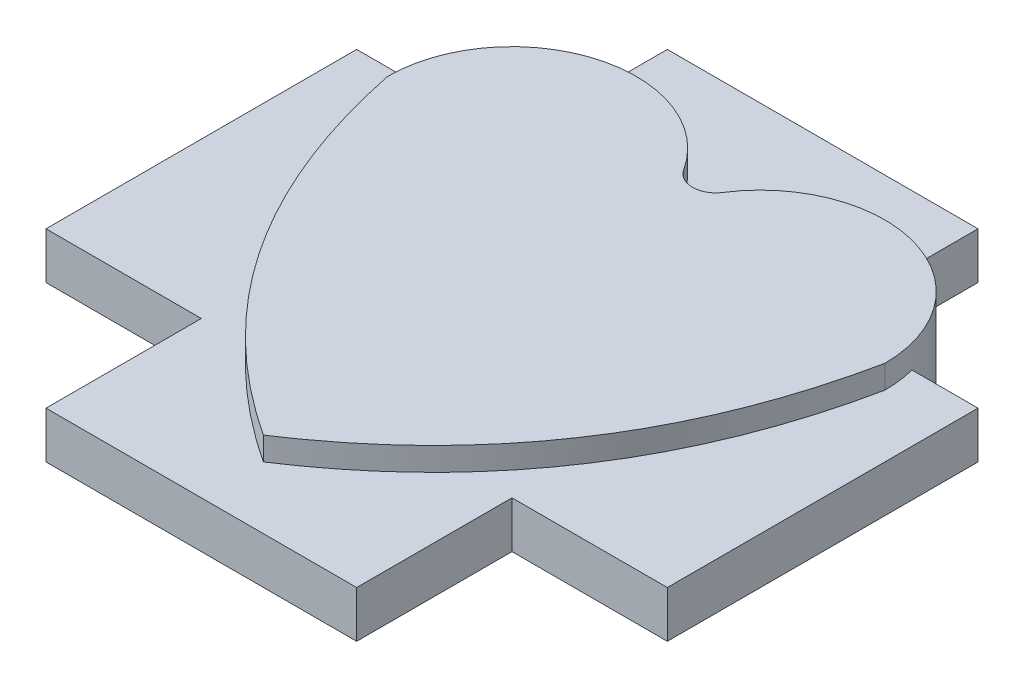
ISO-10303-21;
HEADER;
FILE_DESCRIPTION(('STEP AP214'),'2;1');
FILE_NAME('part.step','',(''),(''),'','','');
FILE_SCHEMA(('AUTOMOTIVE_DESIGN { 1 0 10303 214 1 1 1 1 }'));
ENDSEC;
DATA;
#1=APPLICATION_CONTEXT('core data for automotive mechanical design processes');
#2=APPLICATION_PROTOCOL_DEFINITION('international standard','automotive_design',2000,#1);
#3=PRODUCT_CONTEXT('',#1,'mechanical');
#4=PRODUCT('Part','Part','',(#3));
#5=PRODUCT_RELATED_PRODUCT_CATEGORY('part','',(#4));
#6=PRODUCT_DEFINITION_FORMATION('','',#4);
#7=PRODUCT_DEFINITION_CONTEXT('part definition',#1,'design');
#8=PRODUCT_DEFINITION('design','',#6,#7);
#9=PRODUCT_DEFINITION_SHAPE('','',#8);
#10=(LENGTH_UNIT() NAMED_UNIT(*) SI_UNIT(.MILLI.,.METRE.));
#11=(NAMED_UNIT(*) PLANE_ANGLE_UNIT() SI_UNIT($,.RADIAN.));
#12=(NAMED_UNIT(*) SI_UNIT($,.STERADIAN.) SOLID_ANGLE_UNIT());
#13=UNCERTAINTY_MEASURE_WITH_UNIT(LENGTH_MEASURE(1.E-05),#10,'distance_accuracy_value','');
#14=(GEOMETRIC_REPRESENTATION_CONTEXT(3) GLOBAL_UNCERTAINTY_ASSIGNED_CONTEXT((#13)) GLOBAL_UNIT_ASSIGNED_CONTEXT((#10,
#11,#12)) REPRESENTATION_CONTEXT('',''));
#15=CARTESIAN_POINT('',(0.,0.,0.));
#16=DIRECTION('',(0.,0.,1.));
#17=DIRECTION('',(1.,0.,0.));
#18=AXIS2_PLACEMENT_3D('',#15,#16,#17);
#19=CARTESIAN_POINT('',(8.,3.,-4.));
#20=CARTESIAN_POINT('',(6.40333694662844,3.,3.8115441038304));
#21=CARTESIAN_POINT('',(0.,3.,8.));
#22=B_SPLINE_CURVE_WITH_KNOTS('',2,(#19,#20,#21),.UNSPECIFIED.,.F.,.F.,(3,3),(0.,1.),.UNSPECIFIED.);
#23=DIRECTION('',(0.,-1.,0.));
#24=VECTOR('',#23,1.);
#25=SURFACE_OF_LINEAR_EXTRUSION('',#22,#24);
#26=DIRECTION('',(0.,-1.,0.));
#27=VECTOR('',#26,1.);
#28=CARTESIAN_POINT('',(8.,3.,-4.));
#29=LINE('',#28,#27);
#30=CARTESIAN_POINT('',(8.,0.75,-4.));
#31=VERTEX_POINT('',#30);
#32=CARTESIAN_POINT('',(8.,0.,-4.));
#33=VERTEX_POINT('',#32);
#34=EDGE_CURVE('E51',#31,#33,#29,.T.);
#35=ORIENTED_EDGE('',*,*,#34,.F.);
#36=CARTESIAN_POINT('',(-802083.484499999,0.75,-597230.82877802));
#37=CARTESIAN_POINT('',(798560.307176634,0.75,601924.662589199));
#38=CARTESIAN_POINT('',(-795018.634104275,0.75,-606603.615199584));
#39=B_SPLINE_CURVE_WITH_KNOTS('',2,(#36,#37,#38),.UNSPECIFIED.,.F.,.F.,(3,3),(0.,1.),.UNSPECIFIED.);
#40=CARTESIAN_POINT('',(6.12221384699296E-09,0.75,7.99999999619871));
#41=VERTEX_POINT('',#40);
#42=EDGE_CURVE('E264',#41,#31,#39,.T.);
#43=ORIENTED_EDGE('',*,*,#42,.F.);
#44=DIRECTION('',(0.,-1.,0.));
#45=VECTOR('',#44,1.);
#46=CARTESIAN_POINT('',(0.,3.,8.));
#47=LINE('',#46,#45);
#48=CARTESIAN_POINT('',(0.,0.,8.));
#49=VERTEX_POINT('',#48);
#50=EDGE_CURVE('E430',#41,#49,#47,.T.);
#51=ORIENTED_EDGE('',*,*,#50,.T.);
#52=CARTESIAN_POINT('',(8.,0.,-4.));
#53=CARTESIAN_POINT('',(6.40333694662844,0.,3.8115441038304));
#54=CARTESIAN_POINT('',(0.,0.,8.));
#55=B_SPLINE_CURVE_WITH_KNOTS('',2,(#52,#53,#54),.UNSPECIFIED.,.F.,.F.,(3,3),(0.,1.),.UNSPECIFIED.);
#56=EDGE_CURVE('E394',#33,#49,#55,.T.);
#57=ORIENTED_EDGE('',*,*,#56,.F.);
#58=EDGE_LOOP('',(#35,#43,#51,#57));
#59=FACE_BOUND('',#58,.T.);
#60=ADVANCED_FACE('F41',(#59),#25,.T.);
#61=CARTESIAN_POINT('',(-8.,3.,-4.));
#62=CARTESIAN_POINT('',(-6.40333694662844,3.,3.81154410383039));
#63=CARTESIAN_POINT('',(0.,3.,8.));
#64=B_SPLINE_CURVE_WITH_KNOTS('',2,(#61,#62,#63),.UNSPECIFIED.,.F.,.F.,(3,3),(0.,1.),.UNSPECIFIED.);
#65=DIRECTION('',(0.,-1.,0.));
#66=VECTOR('',#65,1.);
#67=SURFACE_OF_LINEAR_EXTRUSION('',#64,#66);
#68=CARTESIAN_POINT('',(795018.634104553,0.75,-606603.615199218));
#69=CARTESIAN_POINT('',(-798560.307176635,0.75,601924.662589195));
#70=CARTESIAN_POINT('',(802083.484499718,0.75,-597230.828778395));
#71=B_SPLINE_CURVE_WITH_KNOTS('',2,(#68,#69,#70),.UNSPECIFIED.,.F.,.F.,(3,3),(0.,1.),.UNSPECIFIED.);
#72=CARTESIAN_POINT('',(-8.,0.75,-4.));
#73=VERTEX_POINT('',#72);
#74=EDGE_CURVE('E569',#73,#41,#71,.T.);
#75=ORIENTED_EDGE('',*,*,#74,.F.);
#76=DIRECTION('',(0.,-1.,0.));
#77=VECTOR('',#76,1.);
#78=CARTESIAN_POINT('',(-8.,3.,-4.));
#79=LINE('',#78,#77);
#80=CARTESIAN_POINT('',(-8.,0.,-4.));
#81=VERTEX_POINT('',#80);
#82=EDGE_CURVE('E519',#73,#81,#79,.T.);
#83=ORIENTED_EDGE('',*,*,#82,.T.);
#84=CARTESIAN_POINT('',(-8.,0.,-4.));
#85=CARTESIAN_POINT('',(-6.40333694662844,0.,3.81154410383039));
#86=CARTESIAN_POINT('',(0.,0.,8.));
#87=B_SPLINE_CURVE_WITH_KNOTS('',2,(#84,#85,#86),.UNSPECIFIED.,.F.,.F.,(3,3),(0.,1.),.UNSPECIFIED.);
#88=EDGE_CURVE('E411',#81,#49,#87,.T.);
#89=ORIENTED_EDGE('',*,*,#88,.T.);
#90=ORIENTED_EDGE('',*,*,#50,.F.);
#91=EDGE_LOOP('',(#75,#83,#89,#90));
#92=FACE_BOUND('',#91,.T.);
#93=ADVANCED_FACE('F445',(#92),#67,.F.);
#94=CARTESIAN_POINT('',(4.,3.,-4.));
#95=DIRECTION('',(0.,-1.,0.));
#96=DIRECTION('',(0.,0.,-1.));
#97=AXIS2_PLACEMENT_3D('',#94,#95,#96);
#98=CYLINDRICAL_SURFACE('',#97,4.);
#99=CARTESIAN_POINT('',(8.,3.,-4.));
#100=VERTEX_POINT('',#99);
#101=CARTESIAN_POINT('',(8.,2.25,-4.));
#102=VERTEX_POINT('',#101);
#103=EDGE_CURVE('E11',#100,#102,#29,.T.);
#104=ORIENTED_EDGE('',*,*,#103,.T.);
#105=CARTESIAN_POINT('',(4.,2.25,-4.));
#106=DIRECTION('',(0.,1.,0.));
#107=DIRECTION('',(0.,0.,1.));
#108=AXIS2_PLACEMENT_3D('',#105,#106,#107);
#109=CIRCLE('',#108,3.99999999984593);
#110=CARTESIAN_POINT('',(7.87298334620742,2.25,-5.));
#111=VERTEX_POINT('',#110);
#112=EDGE_CURVE('E57',#102,#111,#109,.T.);
#113=ORIENTED_EDGE('',*,*,#112,.T.);
#114=DIRECTION('',(0.,-1.,0.));
#115=VECTOR('',#114,1.);
#116=CARTESIAN_POINT('',(7.8729833460483,2.25,-5.));
#117=LINE('',#116,#115);
#118=CARTESIAN_POINT('',(7.87298334619747,0.75,-5.00000000003852));
#119=VERTEX_POINT('',#118);
#120=EDGE_CURVE('E61',#111,#119,#117,.T.);
#121=ORIENTED_EDGE('',*,*,#120,.T.);
#122=CARTESIAN_POINT('',(4.,0.75,-4.));
#123=DIRECTION('',(0.,1.,0.));
#124=DIRECTION('',(0.,0.,1.));
#125=AXIS2_PLACEMENT_3D('',#122,#123,#124);
#126=CIRCLE('',#125,3.99999999984593);
#127=EDGE_CURVE('E261',#31,#119,#126,.T.);
#128=ORIENTED_EDGE('',*,*,#127,.F.);
#129=ORIENTED_EDGE('',*,*,#34,.T.);
#130=CARTESIAN_POINT('',(4.,0.,-4.));
#131=DIRECTION('',(0.,1.,0.));
#132=DIRECTION('',(0.,0.,1.));
#133=AXIS2_PLACEMENT_3D('',#130,#131,#132);
#134=CIRCLE('',#133,4.);
#135=CARTESIAN_POINT('',(0.631578947368423,0.,-6.1572527928336));
#136=VERTEX_POINT('',#135);
#137=EDGE_CURVE('E544',#33,#136,#134,.T.);
#138=ORIENTED_EDGE('',*,*,#137,.T.);
#139=DIRECTION('',(0.,-1.,0.));
#140=VECTOR('',#139,1.);
#141=CARTESIAN_POINT('',(0.631578947368423,3.,-6.1572527928336));
#142=LINE('',#141,#140);
#143=CARTESIAN_POINT('',(0.631578947498164,0.75,-6.15725279275051));
#144=VERTEX_POINT('',#143);
#145=EDGE_CURVE('E529',#144,#136,#142,.T.);
#146=ORIENTED_EDGE('',*,*,#145,.F.);
#147=CARTESIAN_POINT('',(4.,0.75,-4.));
#148=DIRECTION('',(0.,1.,0.));
#149=DIRECTION('',(0.,0.,1.));
#150=AXIS2_PLACEMENT_3D('',#147,#148,#149);
#151=CIRCLE('',#150,3.99999999984593);
#152=CARTESIAN_POINT('',(5.,0.75,-7.87298334604829));
#153=VERTEX_POINT('',#152);
#154=EDGE_CURVE('E376',#153,#144,#151,.T.);
#155=ORIENTED_EDGE('',*,*,#154,.F.);
#156=DIRECTION('',(0.,1.,0.));
#157=VECTOR('',#156,1.);
#158=CARTESIAN_POINT('',(5.,0.75,-7.87298334604829));
#159=LINE('',#158,#157);
#160=CARTESIAN_POINT('',(5.,2.25,-7.87298334604829));
#161=VERTEX_POINT('',#160);
#162=EDGE_CURVE('E389',#153,#161,#159,.T.);
#163=ORIENTED_EDGE('',*,*,#162,.T.);
#164=CARTESIAN_POINT('',(4.,2.25,-4.));
#165=DIRECTION('',(0.,1.,0.));
#166=DIRECTION('',(0.,0.,1.));
#167=AXIS2_PLACEMENT_3D('',#164,#165,#166);
#168=CIRCLE('',#167,3.99999999984593);
#169=CARTESIAN_POINT('',(0.631578947498164,2.25,-6.15725279275051));
#170=VERTEX_POINT('',#169);
#171=EDGE_CURVE('E354',#161,#170,#168,.T.);
#172=ORIENTED_EDGE('',*,*,#171,.T.);
#173=CARTESIAN_POINT('',(0.631578947368423,3.,-6.1572527928336));
#174=VERTEX_POINT('',#173);
#175=EDGE_CURVE('E530',#174,#170,#142,.T.);
#176=ORIENTED_EDGE('',*,*,#175,.F.);
#177=CARTESIAN_POINT('',(4.,3.,-4.));
#178=DIRECTION('',(0.,1.,0.));
#179=DIRECTION('',(0.,0.,1.));
#180=AXIS2_PLACEMENT_3D('',#177,#178,#179);
#181=CIRCLE('',#180,4.);
#182=EDGE_CURVE('E410',#100,#174,#181,.T.);
#183=ORIENTED_EDGE('',*,*,#182,.F.);
#184=EDGE_LOOP('',(#104,#113,#121,#128,#129,#138,#146,#155,#163,#172,#176,#183));
#185=FACE_BOUND('',#184,.T.);
#186=ADVANCED_FACE('F455',(#185),#98,.T.);
#187=CARTESIAN_POINT('',(0.,3.,-6.5617376914899));
#188=DIRECTION('',(0.,-1.,0.));
#189=DIRECTION('',(0.,0.,-1.));
#190=AXIS2_PLACEMENT_3D('',#187,#188,#189);
#191=CYLINDRICAL_SURFACE('',#190,0.75);
#192=DIRECTION('',(0.,-1.,0.));
#193=VECTOR('',#192,1.);
#194=CARTESIAN_POINT('',(-0.631578947368419,3.,-6.1572527928336));
#195=LINE('',#194,#193);
#196=CARTESIAN_POINT('',(-0.63157894736842,0.75,-6.1572527928336));
#197=VERTEX_POINT('',#196);
#198=CARTESIAN_POINT('',(-0.631578947368419,0.,-6.1572527928336));
#199=VERTEX_POINT('',#198);
#200=EDGE_CURVE('E518',#197,#199,#195,.T.);
#201=ORIENTED_EDGE('',*,*,#200,.F.);
#202=CARTESIAN_POINT('',(0.,0.75,-6.5617376914899));
#203=DIRECTION('',(0.,1.,0.));
#204=DIRECTION('',(0.,0.,1.));
#205=AXIS2_PLACEMENT_3D('',#202,#203,#204);
#206=CIRCLE('',#205,0.75);
#207=EDGE_CURVE('E372',#197,#144,#206,.T.);
#208=ORIENTED_EDGE('',*,*,#207,.T.);
#209=ORIENTED_EDGE('',*,*,#145,.T.);
#210=CARTESIAN_POINT('',(0.,0.,-6.5617376914899));
#211=DIRECTION('',(0.,1.,0.));
#212=DIRECTION('',(0.,0.,1.));
#213=AXIS2_PLACEMENT_3D('',#210,#211,#212);
#214=CIRCLE('',#213,0.75);
#215=EDGE_CURVE('E541',#199,#136,#214,.T.);
#216=ORIENTED_EDGE('',*,*,#215,.F.);
#217=EDGE_LOOP('',(#201,#208,#209,#216));
#218=FACE_BOUND('',#217,.T.);
#219=ADVANCED_FACE('F451',(#218),#191,.F.);
#220=CARTESIAN_POINT('',(-4.,3.,-4.));
#221=DIRECTION('',(0.,-1.,0.));
#222=DIRECTION('',(0.,0.,-1.));
#223=AXIS2_PLACEMENT_3D('',#220,#221,#222);
#224=CYLINDRICAL_SURFACE('',#223,4.);
#225=DIRECTION('',(0.,-1.,0.));
#226=VECTOR('',#225,1.);
#227=CARTESIAN_POINT('',(-7.87298334620742,2.25,-5.));
#228=LINE('',#227,#226);
#229=CARTESIAN_POINT('',(-7.87298334620742,2.25,-5.));
#230=VERTEX_POINT('',#229);
#231=CARTESIAN_POINT('',(-7.87298334620742,0.75,-5.));
#232=VERTEX_POINT('',#231);
#233=EDGE_CURVE('E213',#230,#232,#228,.T.);
#234=ORIENTED_EDGE('',*,*,#233,.F.);
#235=CARTESIAN_POINT('',(-4.,2.25,-4.));
#236=DIRECTION('',(0.,1.,0.));
#237=DIRECTION('',(0.,0.,1.));
#238=AXIS2_PLACEMENT_3D('',#235,#236,#237);
#239=CIRCLE('',#238,4.);
#240=CARTESIAN_POINT('',(-8.,2.25,-4.));
#241=VERTEX_POINT('',#240);
#242=EDGE_CURVE('E278',#230,#241,#239,.T.);
#243=ORIENTED_EDGE('',*,*,#242,.T.);
#244=CARTESIAN_POINT('',(-8.,3.,-4.));
#245=VERTEX_POINT('',#244);
#246=EDGE_CURVE('E515',#245,#241,#79,.T.);
#247=ORIENTED_EDGE('',*,*,#246,.F.);
#248=CARTESIAN_POINT('',(-4.,3.,-4.));
#249=DIRECTION('',(0.,1.,0.));
#250=DIRECTION('',(0.,0.,1.));
#251=AXIS2_PLACEMENT_3D('',#248,#249,#250);
#252=CIRCLE('',#251,4.);
#253=CARTESIAN_POINT('',(-0.631578947368419,3.,-6.1572527928336));
#254=VERTEX_POINT('',#253);
#255=EDGE_CURVE('E421',#254,#245,#252,.T.);
#256=ORIENTED_EDGE('',*,*,#255,.F.);
#257=CARTESIAN_POINT('',(-0.63157894736842,2.25,-6.1572527928336));
#258=VERTEX_POINT('',#257);
#259=EDGE_CURVE('E523',#254,#258,#195,.T.);
#260=ORIENTED_EDGE('',*,*,#259,.T.);
#261=CARTESIAN_POINT('',(-4.,2.25,-4.));
#262=DIRECTION('',(0.,1.,0.));
#263=DIRECTION('',(0.,0.,1.));
#264=AXIS2_PLACEMENT_3D('',#261,#262,#263);
#265=CIRCLE('',#264,4.);
#266=CARTESIAN_POINT('',(-5.,2.25,-7.87298334620742));
#267=VERTEX_POINT('',#266);
#268=EDGE_CURVE('E347',#258,#267,#265,.T.);
#269=ORIENTED_EDGE('',*,*,#268,.T.);
#270=DIRECTION('',(0.,1.,0.));
#271=VECTOR('',#270,1.);
#272=CARTESIAN_POINT('',(-5.,0.75,-7.87298334620742));
#273=LINE('',#272,#271);
#274=CARTESIAN_POINT('',(-5.,0.75,-7.87298334620742));
#275=VERTEX_POINT('',#274);
#276=EDGE_CURVE('E390',#275,#267,#273,.T.);
#277=ORIENTED_EDGE('',*,*,#276,.F.);
#278=CARTESIAN_POINT('',(-4.,0.75,-4.));
#279=DIRECTION('',(0.,1.,0.));
#280=DIRECTION('',(0.,0.,1.));
#281=AXIS2_PLACEMENT_3D('',#278,#279,#280);
#282=CIRCLE('',#281,4.);
#283=EDGE_CURVE('E369',#197,#275,#282,.T.);
#284=ORIENTED_EDGE('',*,*,#283,.F.);
#285=ORIENTED_EDGE('',*,*,#200,.T.);
#286=CARTESIAN_POINT('',(-4.,0.,-4.));
#287=DIRECTION('',(0.,1.,0.));
#288=DIRECTION('',(0.,0.,1.));
#289=AXIS2_PLACEMENT_3D('',#286,#287,#288);
#290=CIRCLE('',#289,4.);
#291=EDGE_CURVE('E552',#199,#81,#290,.T.);
#292=ORIENTED_EDGE('',*,*,#291,.T.);
#293=ORIENTED_EDGE('',*,*,#82,.F.);
#294=CARTESIAN_POINT('',(-4.,0.75,-4.));
#295=DIRECTION('',(0.,1.,0.));
#296=DIRECTION('',(0.,0.,1.));
#297=AXIS2_PLACEMENT_3D('',#294,#295,#296);
#298=CIRCLE('',#297,4.);
#299=EDGE_CURVE('E223',#232,#73,#298,.T.);
#300=ORIENTED_EDGE('',*,*,#299,.F.);
#301=EDGE_LOOP('',(#234,#243,#247,#256,#260,#269,#277,#284,#285,#292,#293,#300));
#302=FACE_BOUND('',#301,.T.);
#303=ADVANCED_FACE('F448',(#302),#224,.T.);
#304=CARTESIAN_POINT('',(-802083.484499999,2.25,-597230.82877802));
#305=CARTESIAN_POINT('',(798560.307176634,2.25,601924.662589199));
#306=CARTESIAN_POINT('',(-795018.634104275,2.25,-606603.615199584));
#307=B_SPLINE_CURVE_WITH_KNOTS('',2,(#304,#305,#306),.UNSPECIFIED.,.F.,.F.,(3,3),(0.,1.),.UNSPECIFIED.);
#308=CARTESIAN_POINT('',(0.,2.25,8.));
#309=VERTEX_POINT('',#308);
#310=EDGE_CURVE('E315',#309,#102,#307,.T.);
#311=ORIENTED_EDGE('',*,*,#310,.T.);
#312=ORIENTED_EDGE('',*,*,#103,.F.);
#313=CARTESIAN_POINT('',(0.,3.,8.));
#314=VERTEX_POINT('',#313);
#315=EDGE_CURVE('E403',#100,#314,#22,.T.);
#316=ORIENTED_EDGE('',*,*,#315,.T.);
#317=EDGE_CURVE('E476',#314,#309,#47,.T.);
#318=ORIENTED_EDGE('',*,*,#317,.T.);
#319=EDGE_LOOP('',(#311,#312,#316,#318));
#320=FACE_BOUND('',#319,.T.);
#321=ADVANCED_FACE('F43',(#320),#25,.T.);
#322=CARTESIAN_POINT('',(0.,2.25,-6.5617376914899));
#323=DIRECTION('',(0.,1.,0.));
#324=DIRECTION('',(0.,0.,1.));
#325=AXIS2_PLACEMENT_3D('',#322,#323,#324);
#326=CIRCLE('',#325,0.75);
#327=EDGE_CURVE('E351',#258,#170,#326,.T.);
#328=ORIENTED_EDGE('',*,*,#327,.F.);
#329=ORIENTED_EDGE('',*,*,#259,.F.);
#330=CARTESIAN_POINT('',(0.,3.,-6.5617376914899));
#331=DIRECTION('',(0.,1.,0.));
#332=DIRECTION('',(0.,0.,1.));
#333=AXIS2_PLACEMENT_3D('',#330,#331,#332);
#334=CIRCLE('',#333,0.75);
#335=EDGE_CURVE('E417',#254,#174,#334,.T.);
#336=ORIENTED_EDGE('',*,*,#335,.T.);
#337=ORIENTED_EDGE('',*,*,#175,.T.);
#338=EDGE_LOOP('',(#328,#329,#336,#337));
#339=FACE_BOUND('',#338,.T.);
#340=ADVANCED_FACE('F443',(#339),#191,.F.);
#341=ORIENTED_EDGE('',*,*,#246,.T.);
#342=CARTESIAN_POINT('',(795018.634104553,2.25,-606603.615199218));
#343=CARTESIAN_POINT('',(-798560.307176635,2.25,601924.662589195));
#344=CARTESIAN_POINT('',(802083.484499718,2.25,-597230.828778395));
#345=B_SPLINE_CURVE_WITH_KNOTS('',2,(#342,#343,#344),.UNSPECIFIED.,.F.,.F.,(3,3),(0.,1.),.UNSPECIFIED.);
#346=EDGE_CURVE('E270',#241,#309,#345,.T.);
#347=ORIENTED_EDGE('',*,*,#346,.T.);
#348=ORIENTED_EDGE('',*,*,#317,.F.);
#349=EDGE_CURVE('E424',#245,#314,#64,.T.);
#350=ORIENTED_EDGE('',*,*,#349,.F.);
#351=EDGE_LOOP('',(#341,#347,#348,#350));
#352=FACE_BOUND('',#351,.T.);
#353=ADVANCED_FACE('F438',(#352),#67,.F.);
#354=CARTESIAN_POINT('',(0.,3.,0.));
#355=DIRECTION('',(0.,1.,0.));
#356=DIRECTION('',(0.,0.,1.));
#357=AXIS2_PLACEMENT_3D('',#354,#355,#356);
#358=PLANE('',#357);
#359=ORIENTED_EDGE('',*,*,#315,.F.);
#360=ORIENTED_EDGE('',*,*,#182,.T.);
#361=ORIENTED_EDGE('',*,*,#335,.F.);
#362=ORIENTED_EDGE('',*,*,#255,.T.);
#363=ORIENTED_EDGE('',*,*,#349,.T.);
#364=EDGE_LOOP('',(#359,#360,#361,#362,#363));
#365=FACE_BOUND('',#364,.T.);
#366=ADVANCED_FACE('F442',(#365),#358,.T.);
#367=CARTESIAN_POINT('',(0.,0.,0.));
#368=DIRECTION('',(0.,1.,0.));
#369=DIRECTION('',(0.,0.,1.));
#370=AXIS2_PLACEMENT_3D('',#367,#368,#369);
#371=PLANE('',#370);
#372=ORIENTED_EDGE('',*,*,#56,.T.);
#373=ORIENTED_EDGE('',*,*,#88,.F.);
#374=ORIENTED_EDGE('',*,*,#291,.F.);
#375=ORIENTED_EDGE('',*,*,#215,.T.);
#376=ORIENTED_EDGE('',*,*,#137,.F.);
#377=EDGE_LOOP('',(#372,#373,#374,#375,#376));
#378=FACE_BOUND('',#377,.T.);
#379=ADVANCED_FACE('F446',(#378),#371,.F.);
#380=CARTESIAN_POINT('',(-5.,0.75,0.));
#381=DIRECTION('',(-1.,0.,0.));
#382=DIRECTION('',(0.,0.,1.));
#383=AXIS2_PLACEMENT_3D('',#380,#381,#382);
#384=PLANE('',#383);
#385=DIRECTION('',(0.,0.,1.));
#386=VECTOR('',#385,1.);
#387=CARTESIAN_POINT('',(-5.,2.25,0.));
#388=LINE('',#387,#386);
#389=CARTESIAN_POINT('',(-5.,2.25,-9.99999999999999));
#390=VERTEX_POINT('',#389);
#391=EDGE_CURVE('E366',#390,#267,#388,.T.);
#392=ORIENTED_EDGE('',*,*,#391,.F.);
#393=DIRECTION('',(0.,1.,0.));
#394=VECTOR('',#393,1.);
#395=CARTESIAN_POINT('',(-5.,0.75,-9.99999999999999));
#396=LINE('',#395,#394);
#397=CARTESIAN_POINT('',(-5.,0.75,-9.99999999999999));
#398=VERTEX_POINT('',#397);
#399=EDGE_CURVE('E395',#398,#390,#396,.T.);
#400=ORIENTED_EDGE('',*,*,#399,.F.);
#401=DIRECTION('',(0.,0.,1.));
#402=VECTOR('',#401,1.);
#403=CARTESIAN_POINT('',(-5.,0.75,0.));
#404=LINE('',#403,#402);
#405=EDGE_CURVE('E385',#398,#275,#404,.T.);
#406=ORIENTED_EDGE('',*,*,#405,.T.);
#407=ORIENTED_EDGE('',*,*,#276,.T.);
#408=EDGE_LOOP('',(#392,#400,#406,#407));
#409=FACE_BOUND('',#408,.T.);
#410=ADVANCED_FACE('F585',(#409),#384,.T.);
#411=CARTESIAN_POINT('',(0.,0.75,-9.99999999999999));
#412=DIRECTION('',(0.,0.,1.));
#413=DIRECTION('',(1.,0.,0.));
#414=AXIS2_PLACEMENT_3D('',#411,#412,#413);
#415=PLANE('',#414);
#416=DIRECTION('',(1.,0.,0.));
#417=VECTOR('',#416,1.);
#418=CARTESIAN_POINT('',(0.,2.25,-9.99999999999999));
#419=LINE('',#418,#417);
#420=CARTESIAN_POINT('',(5.,2.25,-9.99999999999999));
#421=VERTEX_POINT('',#420);
#422=EDGE_CURVE('E362',#390,#421,#419,.T.);
#423=ORIENTED_EDGE('',*,*,#422,.T.);
#424=DIRECTION('',(0.,1.,0.));
#425=VECTOR('',#424,1.);
#426=CARTESIAN_POINT('',(5.,0.75,-9.99999999999999));
#427=LINE('',#426,#425);
#428=CARTESIAN_POINT('',(5.,0.75,-9.99999999999999));
#429=VERTEX_POINT('',#428);
#430=EDGE_CURVE('E398',#429,#421,#427,.T.);
#431=ORIENTED_EDGE('',*,*,#430,.F.);
#432=DIRECTION('',(1.,0.,0.));
#433=VECTOR('',#432,1.);
#434=CARTESIAN_POINT('',(0.,0.75,-9.99999999999999));
#435=LINE('',#434,#433);
#436=EDGE_CURVE('E382',#398,#429,#435,.T.);
#437=ORIENTED_EDGE('',*,*,#436,.F.);
#438=ORIENTED_EDGE('',*,*,#399,.T.);
#439=EDGE_LOOP('',(#423,#431,#437,#438));
#440=FACE_BOUND('',#439,.T.);
#441=ADVANCED_FACE('F590',(#440),#415,.F.);
#442=CARTESIAN_POINT('',(5.,0.75,0.));
#443=DIRECTION('',(-1.,0.,0.));
#444=DIRECTION('',(0.,0.,1.));
#445=AXIS2_PLACEMENT_3D('',#442,#443,#444);
#446=PLANE('',#445);
#447=DIRECTION('',(0.,0.,1.));
#448=VECTOR('',#447,1.);
#449=CARTESIAN_POINT('',(5.,2.25,0.));
#450=LINE('',#449,#448);
#451=EDGE_CURVE('E358',#421,#161,#450,.T.);
#452=ORIENTED_EDGE('',*,*,#451,.T.);
#453=ORIENTED_EDGE('',*,*,#162,.F.);
#454=DIRECTION('',(0.,0.,1.));
#455=VECTOR('',#454,1.);
#456=CARTESIAN_POINT('',(5.,0.75,0.));
#457=LINE('',#456,#455);
#458=EDGE_CURVE('E379',#429,#153,#457,.T.);
#459=ORIENTED_EDGE('',*,*,#458,.F.);
#460=ORIENTED_EDGE('',*,*,#430,.T.);
#461=EDGE_LOOP('',(#452,#453,#459,#460));
#462=FACE_BOUND('',#461,.T.);
#463=ADVANCED_FACE('F594',(#462),#446,.F.);
#464=CARTESIAN_POINT('',(0.,0.75,0.));
#465=DIRECTION('',(0.,1.,0.));
#466=DIRECTION('',(0.,0.,1.));
#467=AXIS2_PLACEMENT_3D('',#464,#465,#466);
#468=PLANE('',#467);
#469=ORIENTED_EDGE('',*,*,#283,.T.);
#470=ORIENTED_EDGE('',*,*,#405,.F.);
#471=ORIENTED_EDGE('',*,*,#436,.T.);
#472=ORIENTED_EDGE('',*,*,#458,.T.);
#473=ORIENTED_EDGE('',*,*,#154,.T.);
#474=ORIENTED_EDGE('',*,*,#207,.F.);
#475=EDGE_LOOP('',(#469,#470,#471,#472,#473,#474));
#476=FACE_BOUND('',#475,.T.);
#477=ADVANCED_FACE('F582',(#476),#468,.F.);
#478=CARTESIAN_POINT('',(0.,2.25,0.));
#479=DIRECTION('',(0.,1.,0.));
#480=DIRECTION('',(0.,0.,1.));
#481=AXIS2_PLACEMENT_3D('',#478,#479,#480);
#482=PLANE('',#481);
#483=ORIENTED_EDGE('',*,*,#268,.F.);
#484=ORIENTED_EDGE('',*,*,#327,.T.);
#485=ORIENTED_EDGE('',*,*,#171,.F.);
#486=ORIENTED_EDGE('',*,*,#451,.F.);
#487=ORIENTED_EDGE('',*,*,#422,.F.);
#488=ORIENTED_EDGE('',*,*,#391,.T.);
#489=EDGE_LOOP('',(#483,#484,#485,#486,#487,#488));
#490=FACE_BOUND('',#489,.T.);
#491=ADVANCED_FACE('F597',(#490),#482,.T.);
#492=CARTESIAN_POINT('',(0.,2.25,-4.99999999999999));
#493=DIRECTION('',(0.,0.,-1.));
#494=DIRECTION('',(-1.,0.,0.));
#495=AXIS2_PLACEMENT_3D('',#492,#493,#494);
#496=PLANE('',#495);
#497=ORIENTED_EDGE('',*,*,#233,.T.);
#498=DIRECTION('',(1.,0.,0.));
#499=VECTOR('',#498,1.);
#500=CARTESIAN_POINT('',(0.,0.75,-4.99999999999999));
#501=LINE('',#500,#499);
#502=CARTESIAN_POINT('',(-10.,0.75,-5.));
#503=VERTEX_POINT('',#502);
#504=EDGE_CURVE('E218',#503,#232,#501,.T.);
#505=ORIENTED_EDGE('',*,*,#504,.F.);
#506=DIRECTION('',(0.,-1.,0.));
#507=VECTOR('',#506,1.);
#508=CARTESIAN_POINT('',(-10.,2.25,-5.));
#509=LINE('',#508,#507);
#510=CARTESIAN_POINT('',(-10.,2.25,-5.));
#511=VERTEX_POINT('',#510);
#512=EDGE_CURVE('E202',#511,#503,#509,.T.);
#513=ORIENTED_EDGE('',*,*,#512,.F.);
#514=DIRECTION('',(1.,0.,0.));
#515=VECTOR('',#514,1.);
#516=CARTESIAN_POINT('',(0.,2.25,-4.99999999999999));
#517=LINE('',#516,#515);
#518=EDGE_CURVE('E284',#511,#230,#517,.T.);
#519=ORIENTED_EDGE('',*,*,#518,.T.);
#520=EDGE_LOOP('',(#497,#505,#513,#519));
#521=FACE_BOUND('',#520,.T.);
#522=ADVANCED_FACE('F219',(#521),#496,.T.);
#523=CARTESIAN_POINT('',(-10.,2.25,0.));
#524=DIRECTION('',(1.,0.,0.));
#525=DIRECTION('',(0.,0.,-1.));
#526=AXIS2_PLACEMENT_3D('',#523,#524,#525);
#527=PLANE('',#526);
#528=ORIENTED_EDGE('',*,*,#512,.T.);
#529=DIRECTION('',(0.,0.,1.));
#530=VECTOR('',#529,1.);
#531=CARTESIAN_POINT('',(-10.,0.75,0.));
#532=LINE('',#531,#530);
#533=CARTESIAN_POINT('',(-10.,0.75,5.));
#534=VERTEX_POINT('',#533);
#535=EDGE_CURVE('E207',#503,#534,#532,.T.);
#536=ORIENTED_EDGE('',*,*,#535,.T.);
#537=DIRECTION('',(0.,-1.,0.));
#538=VECTOR('',#537,1.);
#539=CARTESIAN_POINT('',(-10.,2.25,5.));
#540=LINE('',#539,#538);
#541=CARTESIAN_POINT('',(-10.,2.25,5.));
#542=VERTEX_POINT('',#541);
#543=EDGE_CURVE('E214',#542,#534,#540,.T.);
#544=ORIENTED_EDGE('',*,*,#543,.F.);
#545=DIRECTION('',(0.,0.,1.));
#546=VECTOR('',#545,1.);
#547=CARTESIAN_POINT('',(-10.,2.25,0.));
#548=LINE('',#547,#546);
#549=EDGE_CURVE('E208',#511,#542,#548,.T.);
#550=ORIENTED_EDGE('',*,*,#549,.F.);
#551=EDGE_LOOP('',(#528,#536,#544,#550));
#552=FACE_BOUND('',#551,.T.);
#553=ADVANCED_FACE('F204',(#552),#527,.F.);
#554=CARTESIAN_POINT('',(0.,2.25,5.));
#555=DIRECTION('',(0.,0.,-1.));
#556=DIRECTION('',(-1.,0.,0.));
#557=AXIS2_PLACEMENT_3D('',#554,#555,#556);
#558=PLANE('',#557);
#559=ORIENTED_EDGE('',*,*,#543,.T.);
#560=DIRECTION('',(1.,0.,0.));
#561=VECTOR('',#560,1.);
#562=CARTESIAN_POINT('',(0.,0.75,5.));
#563=LINE('',#562,#561);
#564=CARTESIAN_POINT('',(-5.,0.75,5.));
#565=VERTEX_POINT('',#564);
#566=EDGE_CURVE('E230',#534,#565,#563,.T.);
#567=ORIENTED_EDGE('',*,*,#566,.T.);
#568=DIRECTION('',(0.,-1.,0.));
#569=VECTOR('',#568,1.);
#570=CARTESIAN_POINT('',(-5.,2.25,5.));
#571=LINE('',#570,#569);
#572=CARTESIAN_POINT('',(-5.,2.25,5.));
#573=VERTEX_POINT('',#572);
#574=EDGE_CURVE('E340',#573,#565,#571,.T.);
#575=ORIENTED_EDGE('',*,*,#574,.F.);
#576=DIRECTION('',(1.,0.,0.));
#577=VECTOR('',#576,1.);
#578=CARTESIAN_POINT('',(0.,2.25,5.));
#579=LINE('',#578,#577);
#580=EDGE_CURVE('E289',#542,#573,#579,.T.);
#581=ORIENTED_EDGE('',*,*,#580,.F.);
#582=EDGE_LOOP('',(#559,#567,#575,#581));
#583=FACE_BOUND('',#582,.T.);
#584=ADVANCED_FACE('F509',(#583),#558,.F.);
#585=CARTESIAN_POINT('',(-5.,2.25,0.));
#586=DIRECTION('',(1.,0.,0.));
#587=DIRECTION('',(0.,0.,-1.));
#588=AXIS2_PLACEMENT_3D('',#585,#586,#587);
#589=PLANE('',#588);
#590=ORIENTED_EDGE('',*,*,#574,.T.);
#591=DIRECTION('',(0.,0.,1.));
#592=VECTOR('',#591,1.);
#593=CARTESIAN_POINT('',(-5.,0.75,0.));
#594=LINE('',#593,#592);
#595=CARTESIAN_POINT('',(-5.,0.75,10.));
#596=VERTEX_POINT('',#595);
#597=EDGE_CURVE('E234',#565,#596,#594,.T.);
#598=ORIENTED_EDGE('',*,*,#597,.T.);
#599=DIRECTION('',(0.,-1.,0.));
#600=VECTOR('',#599,1.);
#601=CARTESIAN_POINT('',(-5.,2.25,10.));
#602=LINE('',#601,#600);
#603=CARTESIAN_POINT('',(-5.,2.25,10.));
#604=VERTEX_POINT('',#603);
#605=EDGE_CURVE('E337',#604,#596,#602,.T.);
#606=ORIENTED_EDGE('',*,*,#605,.F.);
#607=DIRECTION('',(0.,0.,1.));
#608=VECTOR('',#607,1.);
#609=CARTESIAN_POINT('',(-5.,2.25,0.));
#610=LINE('',#609,#608);
#611=EDGE_CURVE('E292',#573,#604,#610,.T.);
#612=ORIENTED_EDGE('',*,*,#611,.F.);
#613=EDGE_LOOP('',(#590,#598,#606,#612));
#614=FACE_BOUND('',#613,.T.);
#615=ADVANCED_FACE('F506',(#614),#589,.F.);
#616=CARTESIAN_POINT('',(0.,2.25,10.));
#617=DIRECTION('',(0.,0.,-1.));
#618=DIRECTION('',(-1.,0.,0.));
#619=AXIS2_PLACEMENT_3D('',#616,#617,#618);
#620=PLANE('',#619);
#621=ORIENTED_EDGE('',*,*,#605,.T.);
#622=DIRECTION('',(1.,0.,0.));
#623=VECTOR('',#622,1.);
#624=CARTESIAN_POINT('',(0.,0.75,10.));
#625=LINE('',#624,#623);
#626=CARTESIAN_POINT('',(5.,0.75,10.));
#627=VERTEX_POINT('',#626);
#628=EDGE_CURVE('E241',#596,#627,#625,.T.);
#629=ORIENTED_EDGE('',*,*,#628,.T.);
#630=DIRECTION('',(0.,-1.,0.));
#631=VECTOR('',#630,1.);
#632=CARTESIAN_POINT('',(5.,2.25,10.));
#633=LINE('',#632,#631);
#634=CARTESIAN_POINT('',(5.,2.25,10.));
#635=VERTEX_POINT('',#634);
#636=EDGE_CURVE('E334',#635,#627,#633,.T.);
#637=ORIENTED_EDGE('',*,*,#636,.F.);
#638=DIRECTION('',(1.,0.,0.));
#639=VECTOR('',#638,1.);
#640=CARTESIAN_POINT('',(0.,2.25,10.));
#641=LINE('',#640,#639);
#642=EDGE_CURVE('E295',#604,#635,#641,.T.);
#643=ORIENTED_EDGE('',*,*,#642,.F.);
#644=EDGE_LOOP('',(#621,#629,#637,#643));
#645=FACE_BOUND('',#644,.T.);
#646=ADVANCED_FACE('F501',(#645),#620,.F.);
#647=CARTESIAN_POINT('',(5.,2.25,0.));
#648=DIRECTION('',(1.,0.,0.));
#649=DIRECTION('',(0.,0.,-1.));
#650=AXIS2_PLACEMENT_3D('',#647,#648,#649);
#651=PLANE('',#650);
#652=ORIENTED_EDGE('',*,*,#636,.T.);
#653=DIRECTION('',(0.,0.,1.));
#654=VECTOR('',#653,1.);
#655=CARTESIAN_POINT('',(5.,0.75,0.));
#656=LINE('',#655,#654);
#657=CARTESIAN_POINT('',(5.,0.75,5.));
#658=VERTEX_POINT('',#657);
#659=EDGE_CURVE('E245',#658,#627,#656,.T.);
#660=ORIENTED_EDGE('',*,*,#659,.F.);
#661=DIRECTION('',(0.,-1.,0.));
#662=VECTOR('',#661,1.);
#663=CARTESIAN_POINT('',(5.,2.25,5.));
#664=LINE('',#663,#662);
#665=CARTESIAN_POINT('',(5.,2.25,5.));
#666=VERTEX_POINT('',#665);
#667=EDGE_CURVE('E331',#666,#658,#664,.T.);
#668=ORIENTED_EDGE('',*,*,#667,.F.);
#669=DIRECTION('',(0.,0.,1.));
#670=VECTOR('',#669,1.);
#671=CARTESIAN_POINT('',(5.,2.25,0.));
#672=LINE('',#671,#670);
#673=EDGE_CURVE('E298',#666,#635,#672,.T.);
#674=ORIENTED_EDGE('',*,*,#673,.T.);
#675=EDGE_LOOP('',(#652,#660,#668,#674));
#676=FACE_BOUND('',#675,.T.);
#677=ADVANCED_FACE('F625',(#676),#651,.T.);
#678=CARTESIAN_POINT('',(0.,2.25,5.));
#679=DIRECTION('',(0.,0.,-1.));
#680=DIRECTION('',(-1.,0.,0.));
#681=AXIS2_PLACEMENT_3D('',#678,#679,#680);
#682=PLANE('',#681);
#683=ORIENTED_EDGE('',*,*,#667,.T.);
#684=DIRECTION('',(1.,0.,0.));
#685=VECTOR('',#684,1.);
#686=CARTESIAN_POINT('',(0.,0.75,5.));
#687=LINE('',#686,#685);
#688=CARTESIAN_POINT('',(10.,0.75,5.));
#689=VERTEX_POINT('',#688);
#690=EDGE_CURVE('E249',#658,#689,#687,.T.);
#691=ORIENTED_EDGE('',*,*,#690,.T.);
#692=DIRECTION('',(0.,-1.,0.));
#693=VECTOR('',#692,1.);
#694=CARTESIAN_POINT('',(10.,2.25,5.));
#695=LINE('',#694,#693);
#696=CARTESIAN_POINT('',(10.,2.25,5.));
#697=VERTEX_POINT('',#696);
#698=EDGE_CURVE('E328',#697,#689,#695,.T.);
#699=ORIENTED_EDGE('',*,*,#698,.F.);
#700=DIRECTION('',(1.,0.,0.));
#701=VECTOR('',#700,1.);
#702=CARTESIAN_POINT('',(0.,2.25,5.));
#703=LINE('',#702,#701);
#704=EDGE_CURVE('E302',#666,#697,#703,.T.);
#705=ORIENTED_EDGE('',*,*,#704,.F.);
#706=EDGE_LOOP('',(#683,#691,#699,#705));
#707=FACE_BOUND('',#706,.T.);
#708=ADVANCED_FACE('F494',(#707),#682,.F.);
#709=CARTESIAN_POINT('',(10.,2.25,0.));
#710=DIRECTION('',(1.,0.,0.));
#711=DIRECTION('',(0.,0.,-1.));
#712=AXIS2_PLACEMENT_3D('',#709,#710,#711);
#713=PLANE('',#712);
#714=ORIENTED_EDGE('',*,*,#698,.T.);
#715=DIRECTION('',(0.,0.,1.));
#716=VECTOR('',#715,1.);
#717=CARTESIAN_POINT('',(10.,0.75,0.));
#718=LINE('',#717,#716);
#719=CARTESIAN_POINT('',(10.,0.75,-5.));
#720=VERTEX_POINT('',#719);
#721=EDGE_CURVE('E253',#720,#689,#718,.T.);
#722=ORIENTED_EDGE('',*,*,#721,.F.);
#723=DIRECTION('',(0.,-1.,0.));
#724=VECTOR('',#723,1.);
#725=CARTESIAN_POINT('',(10.,2.25,-5.));
#726=LINE('',#725,#724);
#727=CARTESIAN_POINT('',(10.,2.25,-5.));
#728=VERTEX_POINT('',#727);
#729=EDGE_CURVE('E325',#728,#720,#726,.T.);
#730=ORIENTED_EDGE('',*,*,#729,.F.);
#731=DIRECTION('',(0.,0.,1.));
#732=VECTOR('',#731,1.);
#733=CARTESIAN_POINT('',(10.,2.25,0.));
#734=LINE('',#733,#732);
#735=EDGE_CURVE('E305',#728,#697,#734,.T.);
#736=ORIENTED_EDGE('',*,*,#735,.T.);
#737=EDGE_LOOP('',(#714,#722,#730,#736));
#738=FACE_BOUND('',#737,.T.);
#739=ADVANCED_FACE('F490',(#738),#713,.T.);
#740=CARTESIAN_POINT('',(0.,2.25,-4.99999999999999));
#741=DIRECTION('',(0.,0.,-1.));
#742=DIRECTION('',(-1.,0.,0.));
#743=AXIS2_PLACEMENT_3D('',#740,#741,#742);
#744=PLANE('',#743);
#745=ORIENTED_EDGE('',*,*,#729,.T.);
#746=DIRECTION('',(1.,0.,0.));
#747=VECTOR('',#746,1.);
#748=CARTESIAN_POINT('',(0.,0.75,-4.99999999999999));
#749=LINE('',#748,#747);
#750=EDGE_CURVE('E257',#119,#720,#749,.T.);
#751=ORIENTED_EDGE('',*,*,#750,.F.);
#752=ORIENTED_EDGE('',*,*,#120,.F.);
#753=DIRECTION('',(1.,0.,0.));
#754=VECTOR('',#753,1.);
#755=CARTESIAN_POINT('',(0.,2.25,-4.99999999999999));
#756=LINE('',#755,#754);
#757=EDGE_CURVE('E309',#111,#728,#756,.T.);
#758=ORIENTED_EDGE('',*,*,#757,.T.);
#759=EDGE_LOOP('',(#745,#751,#752,#758));
#760=FACE_BOUND('',#759,.T.);
#761=ADVANCED_FACE('F485',(#760),#744,.T.);
#762=CARTESIAN_POINT('',(0.,2.25,0.));
#763=DIRECTION('',(0.,1.,0.));
#764=DIRECTION('',(0.,0.,1.));
#765=AXIS2_PLACEMENT_3D('',#762,#763,#764);
#766=PLANE('',#765);
#767=ORIENTED_EDGE('',*,*,#346,.F.);
#768=ORIENTED_EDGE('',*,*,#242,.F.);
#769=ORIENTED_EDGE('',*,*,#518,.F.);
#770=ORIENTED_EDGE('',*,*,#549,.T.);
#771=ORIENTED_EDGE('',*,*,#580,.T.);
#772=ORIENTED_EDGE('',*,*,#611,.T.);
#773=ORIENTED_EDGE('',*,*,#642,.T.);
#774=ORIENTED_EDGE('',*,*,#673,.F.);
#775=ORIENTED_EDGE('',*,*,#704,.T.);
#776=ORIENTED_EDGE('',*,*,#735,.F.);
#777=ORIENTED_EDGE('',*,*,#757,.F.);
#778=ORIENTED_EDGE('',*,*,#112,.F.);
#779=ORIENTED_EDGE('',*,*,#310,.F.);
#780=EDGE_LOOP('',(#767,#768,#769,#770,#771,#772,#773,#774,#775,#776,#777,#778,#779));
#781=FACE_BOUND('',#780,.T.);
#782=ADVANCED_FACE('F482',(#781),#766,.T.);
#783=CARTESIAN_POINT('',(0.,0.75,0.));
#784=DIRECTION('',(0.,1.,0.));
#785=DIRECTION('',(0.,0.,1.));
#786=AXIS2_PLACEMENT_3D('',#783,#784,#785);
#787=PLANE('',#786);
#788=ORIENTED_EDGE('',*,*,#74,.T.);
#789=ORIENTED_EDGE('',*,*,#42,.T.);
#790=ORIENTED_EDGE('',*,*,#127,.T.);
#791=ORIENTED_EDGE('',*,*,#750,.T.);
#792=ORIENTED_EDGE('',*,*,#721,.T.);
#793=ORIENTED_EDGE('',*,*,#690,.F.);
#794=ORIENTED_EDGE('',*,*,#659,.T.);
#795=ORIENTED_EDGE('',*,*,#628,.F.);
#796=ORIENTED_EDGE('',*,*,#597,.F.);
#797=ORIENTED_EDGE('',*,*,#566,.F.);
#798=ORIENTED_EDGE('',*,*,#535,.F.);
#799=ORIENTED_EDGE('',*,*,#504,.T.);
#800=ORIENTED_EDGE('',*,*,#299,.T.);
#801=EDGE_LOOP('',(#788,#789,#790,#791,#792,#793,#794,#795,#796,#797,#798,#799,#800));
#802=FACE_BOUND('',#801,.T.);
#803=ADVANCED_FACE('F227',(#802),#787,.F.);
#804=CLOSED_SHELL('',(#60,#93,#186,#219,#303,#321,#340,#353,#366,#379,#410,#441,#463,#477,#491,
#522,#553,#584,#615,#646,#677,#708,#739,#761,#782,#803));
#805=MANIFOLD_SOLID_BREP('B2',#804);
#806=ADVANCED_BREP_SHAPE_REPRESENTATION('',(#18,#805),#14);
#807=SHAPE_DEFINITION_REPRESENTATION(#9,#806);
ENDSEC;
END-ISO-10303-21;
